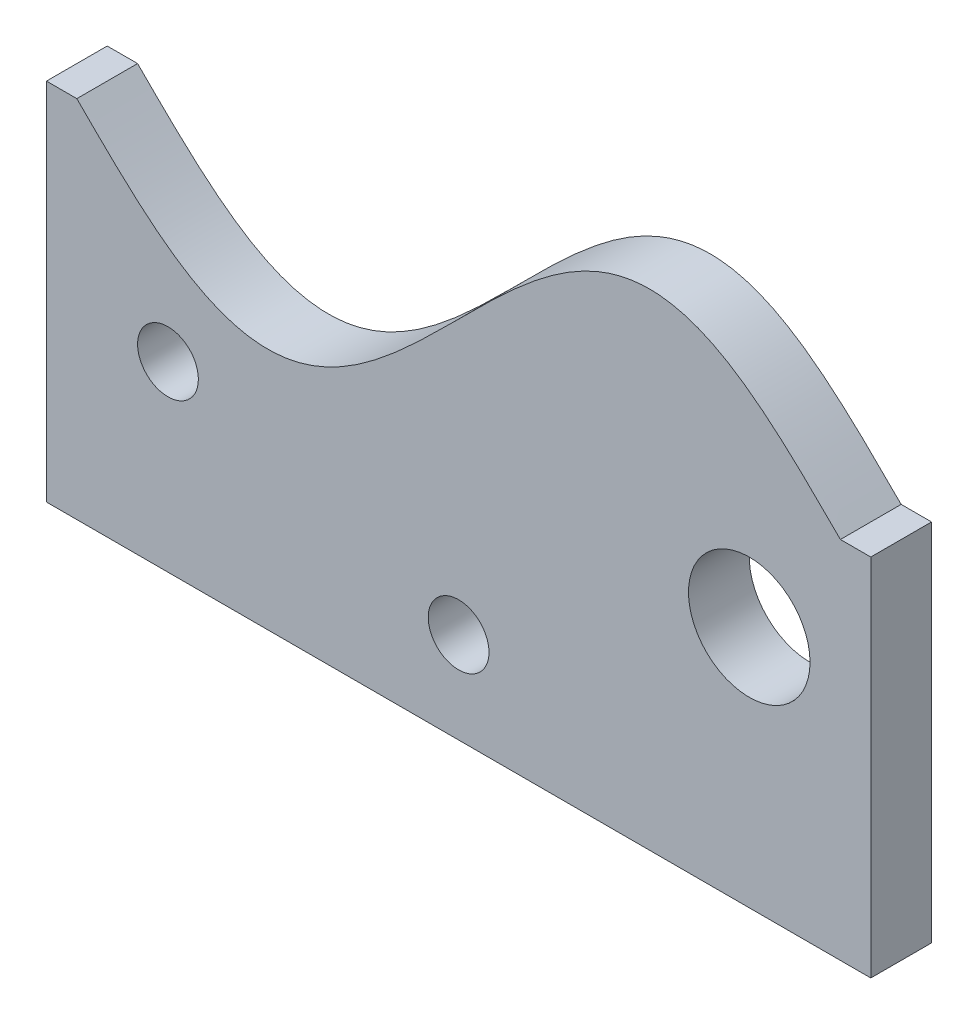
ISO-10303-21;
HEADER;
FILE_DESCRIPTION(('STEP AP214'),'2;1');
FILE_NAME('part.step','',(''),(''),'','','');
FILE_SCHEMA(('AUTOMOTIVE_DESIGN { 1 0 10303 214 1 1 1 1 }'));
ENDSEC;
DATA;
#1=APPLICATION_CONTEXT('core data for automotive mechanical design processes');
#2=APPLICATION_PROTOCOL_DEFINITION('international standard','automotive_design',2000,#1);
#3=PRODUCT_CONTEXT('',#1,'mechanical');
#4=PRODUCT('Part','Part','',(#3));
#5=PRODUCT_RELATED_PRODUCT_CATEGORY('part','',(#4));
#6=PRODUCT_DEFINITION_FORMATION('','',#4);
#7=PRODUCT_DEFINITION_CONTEXT('part definition',#1,'design');
#8=PRODUCT_DEFINITION('design','',#6,#7);
#9=PRODUCT_DEFINITION_SHAPE('','',#8);
#10=(LENGTH_UNIT() NAMED_UNIT(*) SI_UNIT(.MILLI.,.METRE.));
#11=(NAMED_UNIT(*) PLANE_ANGLE_UNIT() SI_UNIT($,.RADIAN.));
#12=(NAMED_UNIT(*) SI_UNIT($,.STERADIAN.) SOLID_ANGLE_UNIT());
#13=UNCERTAINTY_MEASURE_WITH_UNIT(LENGTH_MEASURE(1.E-05),#10,'distance_accuracy_value','');
#14=(GEOMETRIC_REPRESENTATION_CONTEXT(3) GLOBAL_UNCERTAINTY_ASSIGNED_CONTEXT((#13)) GLOBAL_UNIT_ASSIGNED_CONTEXT((#10,
#11,#12)) REPRESENTATION_CONTEXT('',''));
#15=CARTESIAN_POINT('',(0.,0.,0.));
#16=DIRECTION('',(0.,0.,1.));
#17=DIRECTION('',(1.,0.,0.));
#18=AXIS2_PLACEMENT_3D('',#15,#16,#17);
#19=CARTESIAN_POINT('',(3.70325564789121E-07,76.1999997898502,6.35));
#20=DIRECTION('',(0.,0.,-1.));
#21=DIRECTION('',(-1.,0.,0.));
#22=AXIS2_PLACEMENT_3D('',#19,#20,#21);
#23=PLANE('',#22);
#24=CARTESIAN_POINT('',(79.7964534011313,76.2000000000238,6.35));
#25=CARTESIAN_POINT('',(79.4928820372678,76.5035713638876,6.35));
#26=CARTESIAN_POINT('',(78.8752228890463,77.1212306076833,6.35));
#27=CARTESIAN_POINT('',(77.4656073001435,78.5296516804688,6.35));
#28=CARTESIAN_POINT('',(76.22760182878,79.7588435198126,6.35));
#29=CARTESIAN_POINT('',(74.6405617523594,81.3249654237351,6.35));
#30=CARTESIAN_POINT('',(73.2268939325501,82.7004825002855,6.35));
#31=CARTESIAN_POINT('',(71.335322870707,84.5162996802962,6.35));
#32=CARTESIAN_POINT('',(69.2599014008475,86.4549684318067,6.35));
#33=CARTESIAN_POINT('',(66.8931875434714,88.5842277530292,6.35));
#34=CARTESIAN_POINT('',(64.2610290598227,90.8137492714438,6.35));
#35=CARTESIAN_POINT('',(61.7163904237941,92.8275129576126,6.35));
#36=CARTESIAN_POINT('',(58.9271265043349,94.8483598072543,6.35));
#37=CARTESIAN_POINT('',(55.85100311159,96.8244035031377,6.35));
#38=CARTESIAN_POINT('',(52.1352781683724,98.8281878226842,6.35));
#39=CARTESIAN_POINT('',(47.6812046643448,100.601524117008,6.35));
#40=CARTESIAN_POINT('',(42.7563367535368,101.675101344662,6.35));
#41=CARTESIAN_POINT('',(37.4839063927876,101.702652488903,6.35));
#42=CARTESIAN_POINT('',(31.9632692538149,100.599849723051,6.35));
#43=CARTESIAN_POINT('',(26.9589102676086,98.5602564448652,6.35));
#44=CARTESIAN_POINT('',(22.3741440008667,95.9144794571304,6.35));
#45=CARTESIAN_POINT('',(17.555465977886,92.4940257099964,6.35));
#46=CARTESIAN_POINT('',(12.8998350710218,88.6541029136363,6.35));
#47=CARTESIAN_POINT('',(7.93842106820153,84.0825506606059,6.35));
#48=CARTESIAN_POINT('',(2.62748098207468,78.8459542571619,6.35));
#49=CARTESIAN_POINT('',(-2.62747981573513,73.5540450809814,6.35));
#50=CARTESIAN_POINT('',(-7.93842501011991,68.3174515762126,6.35));
#51=CARTESIAN_POINT('',(-12.8998276504571,63.7458928755701,6.35));
#52=CARTESIAN_POINT('',(-17.5554774001328,59.9059807714287,6.35));
#53=CARTESIAN_POINT('',(-22.3741273605539,56.4855111008714,6.35));
#54=CARTESIAN_POINT('',(-26.9589390924999,53.8397599085781,6.35));
#55=CARTESIAN_POINT('',(-31.9632276664263,51.8001266924668,6.35));
#56=CARTESIAN_POINT('',(-37.4839675176554,50.6973821397876,6.35));
#57=CARTESIAN_POINT('',(-42.7562257476031,50.7248359780594,6.35));
#58=CARTESIAN_POINT('',(-47.6813942086682,51.7985819195546,6.35));
#59=CARTESIAN_POINT('',(-51.6614084320771,53.3831067409022,6.35));
#60=CARTESIAN_POINT('',(-54.6897583547126,54.9493531951534,6.35));
#61=CARTESIAN_POINT('',(-57.1348675400792,56.4004468847287,6.35));
#62=CARTESIAN_POINT('',(-58.9999070392442,57.626741230644,6.35));
#63=CARTESIAN_POINT('',(-60.7336876885215,58.8607387124716,6.35));
#64=CARTESIAN_POINT('',(-62.3476909097874,60.0830389759171,6.35));
#65=CARTESIAN_POINT('',(-63.618958786613,61.0865268830522,6.35));
#66=CARTESIAN_POINT('',(-65.1853121186679,62.3691195302023,6.35));
#67=CARTESIAN_POINT('',(-66.8077163859181,63.7566472133859,6.35));
#68=CARTESIAN_POINT('',(-68.4855001529487,65.2479131166562,6.35));
#69=CARTESIAN_POINT('',(-70.2195458880544,66.8415389587351,6.35));
#70=CARTESIAN_POINT('',(-71.5323109250932,68.0766460013016,6.35));
#71=CARTESIAN_POINT('',(-72.6490511576503,69.1443999267341,6.35));
#72=CARTESIAN_POINT('',(-73.5760236020629,70.0405079747473,6.35));
#73=CARTESIAN_POINT('',(-74.3113654602459,70.7564538464271,6.35));
#74=CARTESIAN_POINT('',(-75.0346991928603,71.4650223677087,6.35));
#75=CARTESIAN_POINT('',(-75.8510038355011,72.2705438342871,6.35));
#76=CARTESIAN_POINT('',(-76.8398578210129,73.2463902263709,6.35));
#77=CARTESIAN_POINT('',(-78.4198385357984,74.8233853140177,6.35));
#78=CARTESIAN_POINT('',(-79.189310673391,75.5928572722385,6.35));
#79=CARTESIAN_POINT('',(-79.7964534011519,76.1999999999999,6.35));
#80=B_SPLINE_CURVE_WITH_KNOTS('',4,(#24,#25,#26,#27,#28,#29,#30,#31,#32,#33,#34,#35,#36,#37,#38,
#39,#40,#41,#42,#43,#44,#45,#46,#47,#48,#49,#50,#51,#52,#53,#54,#55,#56,#57,#58,#59,#60,#61,#62,
#63,#64,#65,#66,#67,#68,#69,#70,#71,#72,#73,#74,#75,#76,#77,#78,#79),.UNSPECIFIED.,.F.,.F.,(5,1,
1,1,1,1,1,1,1,1,1,1,1,1,1,1,1,1,1,1,1,1,1,1,1,1,1,1,1,1,1,1,1,1,1,1,1,1,1,1,1,1,1,1,1,1,1,1,1,1,
1,1,5),(0.0832200319625657,0.0920688713935329,0.1009177108245,0.109766550255467,
0.118615389686434,0.127464229117401,0.136313068548368,0.154010747410302,0.167923192508052,
0.181835637605802,0.195748082703552,0.209660527801301,0.227124240249937,0.244587952698573,
0.268184955997209,0.291781559952075,0.31313705088837,0.334492664644994,0.364357185499968,
0.38412815844623,0.403899131392492,0.435932731474462,0.467966331556432,0.500000000000001,
0.53203366844357,0.564067268525541,0.596100868607512,0.615871841553775,0.635642814500037,
0.665507335355012,0.686862949111635,0.708218440047928,0.731815044002792,0.755412047301427,
0.772875759750063,0.781607615974381,0.790339472198699,0.804251917296449,0.811208139845325,
0.8181643623942,0.825120584943075,0.83207680749195,0.8459892525897,0.854838092020667,
0.863686931451634,0.8725357708826,0.876960190598084,0.881384610313567,0.88580903002905,
0.890233449744534,0.894657869460017,0.899082289175501,0.916779968037434),.UNSPECIFIED.);
#81=CARTESIAN_POINT('',(79.7964534011552,76.1999999999999,6.35));
#82=VERTEX_POINT('',#81);
#83=CARTESIAN_POINT('',(-79.796453401152,76.2,6.35));
#84=VERTEX_POINT('',#83);
#85=EDGE_CURVE('E139',#82,#84,#80,.T.);
#86=ORIENTED_EDGE('',*,*,#85,.T.);
#87=DIRECTION('',(-1.,0.,0.));
#88=VECTOR('',#87,1.);
#89=CARTESIAN_POINT('',(-79.796453401152,76.2,6.35));
#90=LINE('',#89,#88);
#91=CARTESIAN_POINT('',(-86.146453401152,76.2,6.35));
#92=VERTEX_POINT('',#91);
#93=EDGE_CURVE('E92',#84,#92,#90,.T.);
#94=ORIENTED_EDGE('',*,*,#93,.T.);
#95=DIRECTION('',(0.,-1.,0.));
#96=VECTOR('',#95,1.);
#97=CARTESIAN_POINT('',(-86.146453401152,76.2,6.35));
#98=LINE('',#97,#96);
#99=CARTESIAN_POINT('',(-86.146453401152,0.,6.35));
#100=VERTEX_POINT('',#99);
#101=EDGE_CURVE('E105',#92,#100,#98,.T.);
#102=ORIENTED_EDGE('',*,*,#101,.T.);
#103=DIRECTION('',(1.,0.,0.));
#104=VECTOR('',#103,1.);
#105=CARTESIAN_POINT('',(-86.146453401152,0.,6.35));
#106=LINE('',#105,#104);
#107=CARTESIAN_POINT('',(86.1464534011552,-1.11022302462516E-13,6.35));
#108=VERTEX_POINT('',#107);
#109=EDGE_CURVE('E99',#100,#108,#106,.T.);
#110=ORIENTED_EDGE('',*,*,#109,.T.);
#111=DIRECTION('',(0.,1.,0.));
#112=VECTOR('',#111,1.);
#113=CARTESIAN_POINT('',(86.1464534011552,76.1999999999999,6.35));
#114=LINE('',#113,#112);
#115=CARTESIAN_POINT('',(86.1464534011552,76.1999999999999,6.35));
#116=VERTEX_POINT('',#115);
#117=EDGE_CURVE('E103',#108,#116,#114,.T.);
#118=ORIENTED_EDGE('',*,*,#117,.T.);
#119=DIRECTION('',(-1.,0.,0.));
#120=VECTOR('',#119,1.);
#121=CARTESIAN_POINT('',(79.7964534011552,76.1999999999999,6.35));
#122=LINE('',#121,#120);
#123=EDGE_CURVE('E55',#116,#82,#122,.T.);
#124=ORIENTED_EDGE('',*,*,#123,.T.);
#125=EDGE_LOOP('',(#86,#94,#102,#110,#118,#124));
#126=FACE_BOUND('',#125,.T.);
#127=CARTESIAN_POINT('',(-60.746453401152,38.1,6.35));
#128=DIRECTION('',(0.,0.,1.));
#129=DIRECTION('',(1.,0.,0.));
#130=AXIS2_PLACEMENT_3D('',#127,#128,#129);
#131=CIRCLE('',#130,6.35000000000946);
#132=CARTESIAN_POINT('',(-54.3964534011425,38.1,6.35));
#133=VERTEX_POINT('',#132);
#134=EDGE_CURVE('E129',#133,#133,#131,.T.);
#135=ORIENTED_EDGE('',*,*,#134,.F.);
#136=EDGE_LOOP('',(#135));
#137=FACE_BOUND('',#136,.T.);
#138=CARTESIAN_POINT('',(0.,19.05,6.35));
#139=DIRECTION('',(0.,0.,1.));
#140=DIRECTION('',(1.,0.,0.));
#141=AXIS2_PLACEMENT_3D('',#138,#139,#140);
#142=CIRCLE('',#141,6.35);
#143=CARTESIAN_POINT('',(6.35,19.05,6.35));
#144=VERTEX_POINT('',#143);
#145=EDGE_CURVE('E193',#144,#144,#142,.T.);
#146=ORIENTED_EDGE('',*,*,#145,.F.);
#147=EDGE_LOOP('',(#146));
#148=FACE_BOUND('',#147,.T.);
#149=CARTESIAN_POINT('',(60.7464534011552,50.8,6.35));
#150=DIRECTION('',(0.,0.,1.));
#151=DIRECTION('',(1.,0.,0.));
#152=AXIS2_PLACEMENT_3D('',#149,#150,#151);
#153=CIRCLE('',#152,12.699999999997);
#154=CARTESIAN_POINT('',(73.4464534011522,50.8,6.35));
#155=VERTEX_POINT('',#154);
#156=EDGE_CURVE('E184',#155,#155,#153,.T.);
#157=ORIENTED_EDGE('',*,*,#156,.F.);
#158=EDGE_LOOP('',(#157));
#159=FACE_BOUND('',#158,.T.);
#160=ADVANCED_FACE('F37',(#126,#137,#148,#159),#23,.F.);
#161=CARTESIAN_POINT('',(3.70325564789121E-07,76.1999997898502,-6.35));
#162=DIRECTION('',(0.,0.,-1.));
#163=DIRECTION('',(-1.,0.,0.));
#164=AXIS2_PLACEMENT_3D('',#161,#162,#163);
#165=PLANE('',#164);
#166=CARTESIAN_POINT('',(0.,19.05,-6.35));
#167=DIRECTION('',(0.,0.,1.));
#168=DIRECTION('',(1.,0.,0.));
#169=AXIS2_PLACEMENT_3D('',#166,#167,#168);
#170=CIRCLE('',#169,6.35);
#171=CARTESIAN_POINT('',(6.35,19.05,-6.35));
#172=VERTEX_POINT('',#171);
#173=EDGE_CURVE('E190',#172,#172,#170,.T.);
#174=ORIENTED_EDGE('',*,*,#173,.T.);
#175=EDGE_LOOP('',(#174));
#176=FACE_BOUND('',#175,.T.);
#177=CARTESIAN_POINT('',(79.7964534011313,76.2000000000238,-6.35));
#178=CARTESIAN_POINT('',(79.4928820372678,76.5035713638876,-6.35));
#179=CARTESIAN_POINT('',(78.8752228890463,77.1212306076833,-6.35));
#180=CARTESIAN_POINT('',(77.4656073001435,78.5296516804688,-6.35));
#181=CARTESIAN_POINT('',(76.22760182878,79.7588435198126,-6.35));
#182=CARTESIAN_POINT('',(74.6405617523594,81.3249654237351,-6.35));
#183=CARTESIAN_POINT('',(73.2268939325501,82.7004825002855,-6.35));
#184=CARTESIAN_POINT('',(71.335322870707,84.5162996802962,-6.35));
#185=CARTESIAN_POINT('',(69.2599014008475,86.4549684318067,-6.35));
#186=CARTESIAN_POINT('',(66.8931875434714,88.5842277530292,-6.35));
#187=CARTESIAN_POINT('',(64.2610290598227,90.8137492714438,-6.35));
#188=CARTESIAN_POINT('',(61.7163904237941,92.8275129576126,-6.35));
#189=CARTESIAN_POINT('',(58.9271265043349,94.8483598072543,-6.35));
#190=CARTESIAN_POINT('',(55.85100311159,96.8244035031377,-6.35));
#191=CARTESIAN_POINT('',(52.1352781683724,98.8281878226842,-6.35));
#192=CARTESIAN_POINT('',(47.6812046643448,100.601524117008,-6.35));
#193=CARTESIAN_POINT('',(42.7563367535368,101.675101344662,-6.35));
#194=CARTESIAN_POINT('',(37.4839063927876,101.702652488903,-6.35));
#195=CARTESIAN_POINT('',(31.9632692538149,100.599849723051,-6.35));
#196=CARTESIAN_POINT('',(26.9589102676086,98.5602564448652,-6.35));
#197=CARTESIAN_POINT('',(22.3741440008667,95.9144794571304,-6.35));
#198=CARTESIAN_POINT('',(17.555465977886,92.4940257099964,-6.35));
#199=CARTESIAN_POINT('',(12.8998350710218,88.6541029136363,-6.35));
#200=CARTESIAN_POINT('',(7.93842106820153,84.0825506606059,-6.35));
#201=CARTESIAN_POINT('',(2.62748098207468,78.8459542571619,-6.35));
#202=CARTESIAN_POINT('',(-2.62747981573513,73.5540450809814,-6.35));
#203=CARTESIAN_POINT('',(-7.93842501011991,68.3174515762126,-6.35));
#204=CARTESIAN_POINT('',(-12.8998276504571,63.7458928755701,-6.35));
#205=CARTESIAN_POINT('',(-17.5554774001328,59.9059807714287,-6.35));
#206=CARTESIAN_POINT('',(-22.3741273605539,56.4855111008714,-6.35));
#207=CARTESIAN_POINT('',(-26.9589390924999,53.8397599085781,-6.35));
#208=CARTESIAN_POINT('',(-31.9632276664263,51.8001266924668,-6.35));
#209=CARTESIAN_POINT('',(-37.4839675176554,50.6973821397876,-6.35));
#210=CARTESIAN_POINT('',(-42.7562257476031,50.7248359780594,-6.35));
#211=CARTESIAN_POINT('',(-47.6813942086682,51.7985819195546,-6.35));
#212=CARTESIAN_POINT('',(-51.6614084320771,53.3831067409022,-6.35));
#213=CARTESIAN_POINT('',(-54.6897583547126,54.9493531951534,-6.35));
#214=CARTESIAN_POINT('',(-57.1348675400792,56.4004468847287,-6.35));
#215=CARTESIAN_POINT('',(-58.9999070392442,57.626741230644,-6.35));
#216=CARTESIAN_POINT('',(-60.7336876885215,58.8607387124716,-6.35));
#217=CARTESIAN_POINT('',(-62.3476909097874,60.0830389759171,-6.35));
#218=CARTESIAN_POINT('',(-63.618958786613,61.0865268830522,-6.35));
#219=CARTESIAN_POINT('',(-65.1853121186679,62.3691195302023,-6.35));
#220=CARTESIAN_POINT('',(-66.8077163859181,63.7566472133859,-6.35));
#221=CARTESIAN_POINT('',(-68.4855001529487,65.2479131166562,-6.35));
#222=CARTESIAN_POINT('',(-70.2195458880544,66.8415389587351,-6.35));
#223=CARTESIAN_POINT('',(-71.5323109250932,68.0766460013016,-6.35));
#224=CARTESIAN_POINT('',(-72.6490511576503,69.1443999267341,-6.35));
#225=CARTESIAN_POINT('',(-73.5760236020629,70.0405079747473,-6.35));
#226=CARTESIAN_POINT('',(-74.3113654602459,70.7564538464271,-6.35));
#227=CARTESIAN_POINT('',(-75.0346991928603,71.4650223677087,-6.35));
#228=CARTESIAN_POINT('',(-75.8510038355011,72.2705438342871,-6.35));
#229=CARTESIAN_POINT('',(-76.8398578210129,73.2463902263709,-6.35));
#230=CARTESIAN_POINT('',(-78.4198385357984,74.8233853140177,-6.35));
#231=CARTESIAN_POINT('',(-79.189310673391,75.5928572722385,-6.35));
#232=CARTESIAN_POINT('',(-79.7964534011519,76.1999999999999,-6.35));
#233=B_SPLINE_CURVE_WITH_KNOTS('',4,(#177,#178,#179,#180,#181,#182,#183,#184,#185,#186,#187,
#188,#189,#190,#191,#192,#193,#194,#195,#196,#197,#198,#199,#200,#201,#202,#203,#204,#205,#206,
#207,#208,#209,#210,#211,#212,#213,#214,#215,#216,#217,#218,#219,#220,#221,#222,#223,#224,#225,
#226,#227,#228,#229,#230,#231,#232),.UNSPECIFIED.,.F.,.F.,(5,1,1,1,1,1,1,1,1,1,1,1,1,1,1,1,1,1,
1,1,1,1,1,1,1,1,1,1,1,1,1,1,1,1,1,1,1,1,1,1,1,1,1,1,1,1,1,1,1,1,1,1,5),(0.0832200319625657,
0.0920688713935329,0.1009177108245,0.109766550255467,0.118615389686434,0.127464229117401,
0.136313068548368,0.154010747410302,0.167923192508052,0.181835637605802,0.195748082703552,
0.209660527801301,0.227124240249937,0.244587952698573,0.268184955997209,0.291781559952075,
0.31313705088837,0.334492664644994,0.364357185499968,0.38412815844623,0.403899131392492,
0.435932731474462,0.467966331556432,0.500000000000001,0.53203366844357,0.564067268525541,
0.596100868607512,0.615871841553775,0.635642814500037,0.665507335355012,0.686862949111635,
0.708218440047928,0.731815044002792,0.755412047301427,0.772875759750063,0.781607615974381,
0.790339472198699,0.804251917296449,0.811208139845325,0.8181643623942,0.825120584943075,
0.83207680749195,0.8459892525897,0.854838092020667,0.863686931451634,0.8725357708826,
0.876960190598084,0.881384610313567,0.88580903002905,0.890233449744534,0.894657869460017,
0.899082289175501,0.916779968037434),.UNSPECIFIED.);
#234=CARTESIAN_POINT('',(79.7964534011552,76.1999999999999,-6.35));
#235=VERTEX_POINT('',#234);
#236=CARTESIAN_POINT('',(-79.796453401152,76.2,-6.35));
#237=VERTEX_POINT('',#236);
#238=EDGE_CURVE('E123',#235,#237,#233,.T.);
#239=ORIENTED_EDGE('',*,*,#238,.F.);
#240=DIRECTION('',(-1.,0.,0.));
#241=VECTOR('',#240,1.);
#242=CARTESIAN_POINT('',(79.7964534011552,76.1999999999999,-6.35));
#243=LINE('',#242,#241);
#244=CARTESIAN_POINT('',(86.1464534011552,76.1999999999999,-6.35));
#245=VERTEX_POINT('',#244);
#246=EDGE_CURVE('E84',#245,#235,#243,.T.);
#247=ORIENTED_EDGE('',*,*,#246,.F.);
#248=DIRECTION('',(0.,1.,0.));
#249=VECTOR('',#248,1.);
#250=CARTESIAN_POINT('',(86.1464534011552,76.1999999999999,-6.35));
#251=LINE('',#250,#249);
#252=CARTESIAN_POINT('',(86.1464534011552,-1.11022302462516E-13,-6.35));
#253=VERTEX_POINT('',#252);
#254=EDGE_CURVE('E78',#253,#245,#251,.T.);
#255=ORIENTED_EDGE('',*,*,#254,.F.);
#256=DIRECTION('',(1.,0.,0.));
#257=VECTOR('',#256,1.);
#258=CARTESIAN_POINT('',(-86.146453401152,0.,-6.35));
#259=LINE('',#258,#257);
#260=CARTESIAN_POINT('',(-86.146453401152,0.,-6.35));
#261=VERTEX_POINT('',#260);
#262=EDGE_CURVE('E113',#261,#253,#259,.T.);
#263=ORIENTED_EDGE('',*,*,#262,.F.);
#264=DIRECTION('',(0.,-1.,0.));
#265=VECTOR('',#264,1.);
#266=CARTESIAN_POINT('',(-86.146453401152,76.2,-6.35));
#267=LINE('',#266,#265);
#268=CARTESIAN_POINT('',(-86.146453401152,76.2,-6.35));
#269=VERTEX_POINT('',#268);
#270=EDGE_CURVE('E134',#269,#261,#267,.T.);
#271=ORIENTED_EDGE('',*,*,#270,.F.);
#272=DIRECTION('',(-1.,0.,0.));
#273=VECTOR('',#272,1.);
#274=CARTESIAN_POINT('',(-79.796453401152,76.2,-6.35));
#275=LINE('',#274,#273);
#276=EDGE_CURVE('E128',#237,#269,#275,.T.);
#277=ORIENTED_EDGE('',*,*,#276,.F.);
#278=EDGE_LOOP('',(#239,#247,#255,#263,#271,#277));
#279=FACE_BOUND('',#278,.T.);
#280=CARTESIAN_POINT('',(-60.746453401152,38.1,-6.35));
#281=DIRECTION('',(0.,0.,1.));
#282=DIRECTION('',(1.,0.,0.));
#283=AXIS2_PLACEMENT_3D('',#280,#281,#282);
#284=CIRCLE('',#283,6.35000000000946);
#285=CARTESIAN_POINT('',(-54.3964534011425,38.1,-6.35));
#286=VERTEX_POINT('',#285);
#287=EDGE_CURVE('E196',#286,#286,#284,.T.);
#288=ORIENTED_EDGE('',*,*,#287,.T.);
#289=EDGE_LOOP('',(#288));
#290=FACE_BOUND('',#289,.T.);
#291=CARTESIAN_POINT('',(60.7464534011552,50.8,-6.35));
#292=DIRECTION('',(0.,0.,1.));
#293=DIRECTION('',(1.,0.,0.));
#294=AXIS2_PLACEMENT_3D('',#291,#292,#293);
#295=CIRCLE('',#294,12.699999999997);
#296=CARTESIAN_POINT('',(73.4464534011522,50.8,-6.35));
#297=VERTEX_POINT('',#296);
#298=EDGE_CURVE('E187',#297,#297,#295,.T.);
#299=ORIENTED_EDGE('',*,*,#298,.T.);
#300=EDGE_LOOP('',(#299));
#301=FACE_BOUND('',#300,.T.);
#302=ADVANCED_FACE('F148',(#176,#279,#290,#301),#165,.T.);
#303=DIRECTION('',(0.,0.,-1.));
#304=VECTOR('',#303,1.);
#305=SURFACE_OF_LINEAR_EXTRUSION('',#80,#304);
#306=ORIENTED_EDGE('',*,*,#238,.T.);
#307=DIRECTION('',(0.,0.,-1.));
#308=VECTOR('',#307,1.);
#309=CARTESIAN_POINT('',(-79.796453401152,76.2,6.35));
#310=LINE('',#309,#308);
#311=EDGE_CURVE('E11',#84,#237,#310,.T.);
#312=ORIENTED_EDGE('',*,*,#311,.F.);
#313=ORIENTED_EDGE('',*,*,#85,.F.);
#314=DIRECTION('',(0.,0.,-1.));
#315=VECTOR('',#314,1.);
#316=CARTESIAN_POINT('',(79.7964534011552,76.1999999999999,6.35));
#317=LINE('',#316,#315);
#318=EDGE_CURVE('E119',#82,#235,#317,.T.);
#319=ORIENTED_EDGE('',*,*,#318,.T.);
#320=EDGE_LOOP('',(#306,#312,#313,#319));
#321=FACE_BOUND('',#320,.T.);
#322=ADVANCED_FACE('F39',(#321),#305,.F.);
#323=CARTESIAN_POINT('',(-79.796453401152,76.2,6.35));
#324=DIRECTION('',(0.,-1.,0.));
#325=DIRECTION('',(0.,0.,-1.));
#326=AXIS2_PLACEMENT_3D('',#323,#324,#325);
#327=PLANE('',#326);
#328=ORIENTED_EDGE('',*,*,#276,.T.);
#329=DIRECTION('',(0.,0.,-1.));
#330=VECTOR('',#329,1.);
#331=CARTESIAN_POINT('',(-86.146453401152,76.2,6.35));
#332=LINE('',#331,#330);
#333=EDGE_CURVE('E47',#92,#269,#332,.T.);
#334=ORIENTED_EDGE('',*,*,#333,.F.);
#335=ORIENTED_EDGE('',*,*,#93,.F.);
#336=ORIENTED_EDGE('',*,*,#311,.T.);
#337=EDGE_LOOP('',(#328,#334,#335,#336));
#338=FACE_BOUND('',#337,.T.);
#339=ADVANCED_FACE('F256',(#338),#327,.F.);
#340=CARTESIAN_POINT('',(-86.146453401152,76.2,6.35));
#341=DIRECTION('',(1.,0.,0.));
#342=DIRECTION('',(0.,0.,-1.));
#343=AXIS2_PLACEMENT_3D('',#340,#341,#342);
#344=PLANE('',#343);
#345=ORIENTED_EDGE('',*,*,#270,.T.);
#346=DIRECTION('',(0.,0.,-1.));
#347=VECTOR('',#346,1.);
#348=CARTESIAN_POINT('',(-86.146453401152,0.,6.35));
#349=LINE('',#348,#347);
#350=EDGE_CURVE('E114',#100,#261,#349,.T.);
#351=ORIENTED_EDGE('',*,*,#350,.F.);
#352=ORIENTED_EDGE('',*,*,#101,.F.);
#353=ORIENTED_EDGE('',*,*,#333,.T.);
#354=EDGE_LOOP('',(#345,#351,#352,#353));
#355=FACE_BOUND('',#354,.T.);
#356=ADVANCED_FACE('F145',(#355),#344,.F.);
#357=CARTESIAN_POINT('',(-86.146453401152,0.,6.35));
#358=DIRECTION('',(0.,1.,0.));
#359=DIRECTION('',(-1.,0.,0.));
#360=AXIS2_PLACEMENT_3D('',#357,#358,#359);
#361=PLANE('',#360);
#362=ORIENTED_EDGE('',*,*,#262,.T.);
#363=DIRECTION('',(0.,0.,-1.));
#364=VECTOR('',#363,1.);
#365=CARTESIAN_POINT('',(86.1464534011552,-1.11022302462516E-13,6.35));
#366=LINE('',#365,#364);
#367=EDGE_CURVE('E110',#108,#253,#366,.T.);
#368=ORIENTED_EDGE('',*,*,#367,.F.);
#369=ORIENTED_EDGE('',*,*,#109,.F.);
#370=ORIENTED_EDGE('',*,*,#350,.T.);
#371=EDGE_LOOP('',(#362,#368,#369,#370));
#372=FACE_BOUND('',#371,.T.);
#373=ADVANCED_FACE('F111',(#372),#361,.F.);
#374=CARTESIAN_POINT('',(86.1464534011552,76.1999999999999,6.35));
#375=DIRECTION('',(-1.,0.,0.));
#376=DIRECTION('',(0.,0.,1.));
#377=AXIS2_PLACEMENT_3D('',#374,#375,#376);
#378=PLANE('',#377);
#379=ORIENTED_EDGE('',*,*,#254,.T.);
#380=DIRECTION('',(0.,0.,-1.));
#381=VECTOR('',#380,1.);
#382=CARTESIAN_POINT('',(86.1464534011552,76.1999999999999,6.35));
#383=LINE('',#382,#381);
#384=EDGE_CURVE('E115',#116,#245,#383,.T.);
#385=ORIENTED_EDGE('',*,*,#384,.F.);
#386=ORIENTED_EDGE('',*,*,#117,.F.);
#387=ORIENTED_EDGE('',*,*,#367,.T.);
#388=EDGE_LOOP('',(#379,#385,#386,#387));
#389=FACE_BOUND('',#388,.T.);
#390=ADVANCED_FACE('F117',(#389),#378,.F.);
#391=CARTESIAN_POINT('',(79.7964534011552,76.1999999999999,6.35));
#392=DIRECTION('',(0.,-1.,0.));
#393=DIRECTION('',(0.,0.,-1.));
#394=AXIS2_PLACEMENT_3D('',#391,#392,#393);
#395=PLANE('',#394);
#396=ORIENTED_EDGE('',*,*,#246,.T.);
#397=ORIENTED_EDGE('',*,*,#318,.F.);
#398=ORIENTED_EDGE('',*,*,#123,.F.);
#399=ORIENTED_EDGE('',*,*,#384,.T.);
#400=EDGE_LOOP('',(#396,#397,#398,#399));
#401=FACE_BOUND('',#400,.T.);
#402=ADVANCED_FACE('F153',(#401),#395,.F.);
#403=CARTESIAN_POINT('',(-60.746453401152,38.1,6.35));
#404=DIRECTION('',(0.,0.,-1.));
#405=DIRECTION('',(-1.,0.,0.));
#406=AXIS2_PLACEMENT_3D('',#403,#404,#405);
#407=CYLINDRICAL_SURFACE('',#406,6.35000000000946);
#408=ORIENTED_EDGE('',*,*,#134,.T.);
#409=EDGE_LOOP('',(#408));
#410=FACE_BOUND('',#409,.T.);
#411=ORIENTED_EDGE('',*,*,#287,.F.);
#412=EDGE_LOOP('',(#411));
#413=FACE_BOUND('',#412,.T.);
#414=ADVANCED_FACE('F155',(#410,#413),#407,.F.);
#415=CARTESIAN_POINT('',(0.,19.05,6.35));
#416=DIRECTION('',(0.,0.,-1.));
#417=DIRECTION('',(-1.,0.,0.));
#418=AXIS2_PLACEMENT_3D('',#415,#416,#417);
#419=CYLINDRICAL_SURFACE('',#418,6.35);
#420=ORIENTED_EDGE('',*,*,#145,.T.);
#421=EDGE_LOOP('',(#420));
#422=FACE_BOUND('',#421,.T.);
#423=ORIENTED_EDGE('',*,*,#173,.F.);
#424=EDGE_LOOP('',(#423));
#425=FACE_BOUND('',#424,.T.);
#426=ADVANCED_FACE('F161',(#422,#425),#419,.F.);
#427=CARTESIAN_POINT('',(60.7464534011552,50.8,6.35));
#428=DIRECTION('',(0.,0.,-1.));
#429=DIRECTION('',(-1.,0.,0.));
#430=AXIS2_PLACEMENT_3D('',#427,#428,#429);
#431=CYLINDRICAL_SURFACE('',#430,12.699999999997);
#432=ORIENTED_EDGE('',*,*,#156,.T.);
#433=EDGE_LOOP('',(#432));
#434=FACE_BOUND('',#433,.T.);
#435=ORIENTED_EDGE('',*,*,#298,.F.);
#436=EDGE_LOOP('',(#435));
#437=FACE_BOUND('',#436,.T.);
#438=ADVANCED_FACE('F175',(#434,#437),#431,.F.);
#439=CLOSED_SHELL('',(#160,#302,#322,#339,#356,#373,#390,#402,#414,#426,#438));
#440=MANIFOLD_SOLID_BREP('B2',#439);
#441=ADVANCED_BREP_SHAPE_REPRESENTATION('',(#18,#440),#14);
#442=SHAPE_DEFINITION_REPRESENTATION(#9,#441);
ENDSEC;
END-ISO-10303-21;
